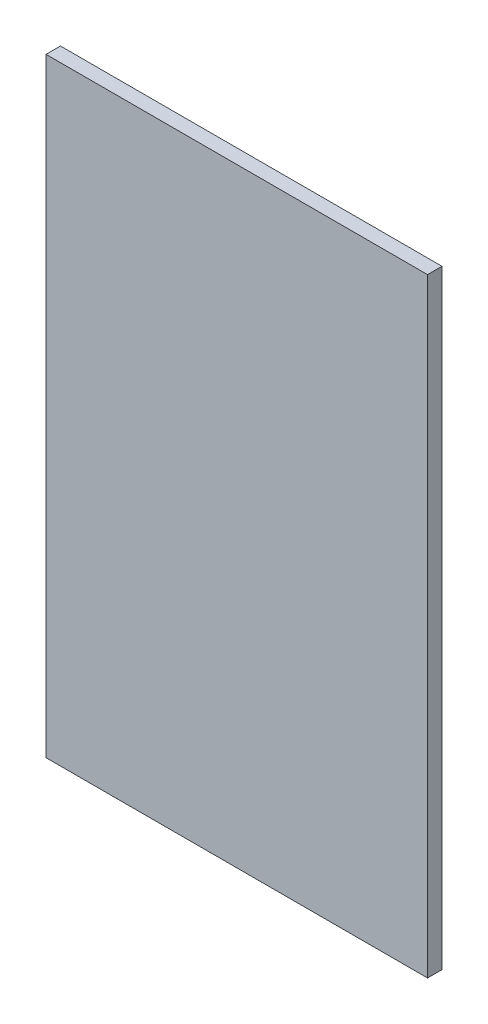
ISO-10303-21;
HEADER;
FILE_DESCRIPTION(('STEP AP214'),'2;1');
FILE_NAME('part.step','',(''),(''),'','','');
FILE_SCHEMA(('AUTOMOTIVE_DESIGN { 1 0 10303 214 1 1 1 1 }'));
ENDSEC;
DATA;
#1=APPLICATION_CONTEXT('core data for automotive mechanical design processes');
#2=APPLICATION_PROTOCOL_DEFINITION('international standard','automotive_design',2000,#1);
#3=PRODUCT_CONTEXT('',#1,'mechanical');
#4=PRODUCT('Part','Part','',(#3));
#5=PRODUCT_RELATED_PRODUCT_CATEGORY('part','',(#4));
#6=PRODUCT_DEFINITION_FORMATION('','',#4);
#7=PRODUCT_DEFINITION_CONTEXT('part definition',#1,'design');
#8=PRODUCT_DEFINITION('design','',#6,#7);
#9=PRODUCT_DEFINITION_SHAPE('','',#8);
#10=(LENGTH_UNIT() NAMED_UNIT(*) SI_UNIT(.MILLI.,.METRE.));
#11=(NAMED_UNIT(*) PLANE_ANGLE_UNIT() SI_UNIT($,.RADIAN.));
#12=(NAMED_UNIT(*) SI_UNIT($,.STERADIAN.) SOLID_ANGLE_UNIT());
#13=UNCERTAINTY_MEASURE_WITH_UNIT(LENGTH_MEASURE(1.E-05),#10,'distance_accuracy_value','');
#14=(GEOMETRIC_REPRESENTATION_CONTEXT(3) GLOBAL_UNCERTAINTY_ASSIGNED_CONTEXT((#13)) GLOBAL_UNIT_ASSIGNED_CONTEXT((#10,
#11,#12)) REPRESENTATION_CONTEXT('',''));
#15=CARTESIAN_POINT('',(0.,0.,0.));
#16=DIRECTION('',(0.,0.,1.));
#17=DIRECTION('',(1.,0.,0.));
#18=AXIS2_PLACEMENT_3D('',#15,#16,#17);
#19=CARTESIAN_POINT('',(-238.,-380.,18.));
#20=DIRECTION('',(1.,0.,0.));
#21=DIRECTION('',(0.,0.,-1.));
#22=AXIS2_PLACEMENT_3D('',#19,#20,#21);
#23=PLANE('',#22);
#24=DIRECTION('',(0.,-1.,0.));
#25=VECTOR('',#24,1.);
#26=CARTESIAN_POINT('',(-238.,-380.,0.));
#27=LINE('',#26,#25);
#28=CARTESIAN_POINT('',(-238.,380.,0.));
#29=VERTEX_POINT('',#28);
#30=CARTESIAN_POINT('',(-238.,-380.,0.));
#31=VERTEX_POINT('',#30);
#32=EDGE_CURVE('E96',#29,#31,#27,.T.);
#33=ORIENTED_EDGE('',*,*,#32,.T.);
#34=DIRECTION('',(0.,0.,-1.));
#35=VECTOR('',#34,1.);
#36=CARTESIAN_POINT('',(-238.,-380.,18.));
#37=LINE('',#36,#35);
#38=CARTESIAN_POINT('',(-238.,-380.,18.));
#39=VERTEX_POINT('',#38);
#40=EDGE_CURVE('E11',#39,#31,#37,.T.);
#41=ORIENTED_EDGE('',*,*,#40,.F.);
#42=DIRECTION('',(0.,-1.,0.));
#43=VECTOR('',#42,1.);
#44=CARTESIAN_POINT('',(-238.,-380.,18.));
#45=LINE('',#44,#43);
#46=CARTESIAN_POINT('',(-238.,380.,18.));
#47=VERTEX_POINT('',#46);
#48=EDGE_CURVE('E84',#47,#39,#45,.T.);
#49=ORIENTED_EDGE('',*,*,#48,.F.);
#50=DIRECTION('',(0.,0.,-1.));
#51=VECTOR('',#50,1.);
#52=CARTESIAN_POINT('',(-238.,380.,18.));
#53=LINE('',#52,#51);
#54=EDGE_CURVE('E92',#47,#29,#53,.T.);
#55=ORIENTED_EDGE('',*,*,#54,.T.);
#56=EDGE_LOOP('',(#33,#41,#49,#55));
#57=FACE_BOUND('',#56,.T.);
#58=ADVANCED_FACE('F33',(#57),#23,.F.);
#59=CARTESIAN_POINT('',(238.,-380.,18.));
#60=DIRECTION('',(0.,1.,0.));
#61=DIRECTION('',(-1.,0.,0.));
#62=AXIS2_PLACEMENT_3D('',#59,#60,#61);
#63=PLANE('',#62);
#64=DIRECTION('',(1.,0.,0.));
#65=VECTOR('',#64,1.);
#66=CARTESIAN_POINT('',(238.,-380.,0.));
#67=LINE('',#66,#65);
#68=CARTESIAN_POINT('',(238.,-380.,0.));
#69=VERTEX_POINT('',#68);
#70=EDGE_CURVE('E88',#31,#69,#67,.T.);
#71=ORIENTED_EDGE('',*,*,#70,.T.);
#72=DIRECTION('',(0.,0.,-1.));
#73=VECTOR('',#72,1.);
#74=CARTESIAN_POINT('',(238.,-380.,18.));
#75=LINE('',#74,#73);
#76=CARTESIAN_POINT('',(238.,-380.,18.));
#77=VERTEX_POINT('',#76);
#78=EDGE_CURVE('E41',#77,#69,#75,.T.);
#79=ORIENTED_EDGE('',*,*,#78,.F.);
#80=DIRECTION('',(1.,0.,0.));
#81=VECTOR('',#80,1.);
#82=CARTESIAN_POINT('',(238.,-380.,18.));
#83=LINE('',#82,#81);
#84=EDGE_CURVE('E79',#39,#77,#83,.T.);
#85=ORIENTED_EDGE('',*,*,#84,.F.);
#86=ORIENTED_EDGE('',*,*,#40,.T.);
#87=EDGE_LOOP('',(#71,#79,#85,#86));
#88=FACE_BOUND('',#87,.T.);
#89=ADVANCED_FACE('F87',(#88),#63,.F.);
#90=CARTESIAN_POINT('',(238.,-380.,18.));
#91=DIRECTION('',(-1.,0.,0.));
#92=DIRECTION('',(0.,0.,1.));
#93=AXIS2_PLACEMENT_3D('',#90,#91,#92);
#94=PLANE('',#93);
#95=DIRECTION('',(0.,1.,0.));
#96=VECTOR('',#95,1.);
#97=CARTESIAN_POINT('',(238.,-380.,0.));
#98=LINE('',#97,#96);
#99=CARTESIAN_POINT('',(238.,380.,0.));
#100=VERTEX_POINT('',#99);
#101=EDGE_CURVE('E66',#69,#100,#98,.T.);
#102=ORIENTED_EDGE('',*,*,#101,.T.);
#103=DIRECTION('',(0.,0.,-1.));
#104=VECTOR('',#103,1.);
#105=CARTESIAN_POINT('',(238.,380.,18.));
#106=LINE('',#105,#104);
#107=CARTESIAN_POINT('',(238.,380.,18.));
#108=VERTEX_POINT('',#107);
#109=EDGE_CURVE('E89',#108,#100,#106,.T.);
#110=ORIENTED_EDGE('',*,*,#109,.F.);
#111=DIRECTION('',(0.,1.,0.));
#112=VECTOR('',#111,1.);
#113=CARTESIAN_POINT('',(238.,-380.,18.));
#114=LINE('',#113,#112);
#115=EDGE_CURVE('E82',#77,#108,#114,.T.);
#116=ORIENTED_EDGE('',*,*,#115,.F.);
#117=ORIENTED_EDGE('',*,*,#78,.T.);
#118=EDGE_LOOP('',(#102,#110,#116,#117));
#119=FACE_BOUND('',#118,.T.);
#120=ADVANCED_FACE('F90',(#119),#94,.F.);
#121=CARTESIAN_POINT('',(238.,380.,18.));
#122=DIRECTION('',(0.,-1.,0.));
#123=DIRECTION('',(1.,0.,0.));
#124=AXIS2_PLACEMENT_3D('',#121,#122,#123);
#125=PLANE('',#124);
#126=DIRECTION('',(-1.,0.,0.));
#127=VECTOR('',#126,1.);
#128=CARTESIAN_POINT('',(238.,380.,0.));
#129=LINE('',#128,#127);
#130=EDGE_CURVE('E72',#100,#29,#129,.T.);
#131=ORIENTED_EDGE('',*,*,#130,.T.);
#132=ORIENTED_EDGE('',*,*,#54,.F.);
#133=DIRECTION('',(-1.,0.,0.));
#134=VECTOR('',#133,1.);
#135=CARTESIAN_POINT('',(238.,380.,18.));
#136=LINE('',#135,#134);
#137=EDGE_CURVE('E49',#108,#47,#136,.T.);
#138=ORIENTED_EDGE('',*,*,#137,.F.);
#139=ORIENTED_EDGE('',*,*,#109,.T.);
#140=EDGE_LOOP('',(#131,#132,#138,#139));
#141=FACE_BOUND('',#140,.T.);
#142=ADVANCED_FACE('F103',(#141),#125,.F.);
#143=CARTESIAN_POINT('',(0.,0.,18.));
#144=DIRECTION('',(0.,0.,1.));
#145=DIRECTION('',(1.,0.,0.));
#146=AXIS2_PLACEMENT_3D('',#143,#144,#145);
#147=PLANE('',#146);
#148=ORIENTED_EDGE('',*,*,#48,.T.);
#149=ORIENTED_EDGE('',*,*,#84,.T.);
#150=ORIENTED_EDGE('',*,*,#115,.T.);
#151=ORIENTED_EDGE('',*,*,#137,.T.);
#152=EDGE_LOOP('',(#148,#149,#150,#151));
#153=FACE_BOUND('',#152,.T.);
#154=ADVANCED_FACE('F80',(#153),#147,.T.);
#155=CARTESIAN_POINT('',(0.,0.,0.));
#156=DIRECTION('',(0.,0.,1.));
#157=DIRECTION('',(1.,0.,0.));
#158=AXIS2_PLACEMENT_3D('',#155,#156,#157);
#159=PLANE('',#158);
#160=ORIENTED_EDGE('',*,*,#32,.F.);
#161=ORIENTED_EDGE('',*,*,#130,.F.);
#162=ORIENTED_EDGE('',*,*,#101,.F.);
#163=ORIENTED_EDGE('',*,*,#70,.F.);
#164=EDGE_LOOP('',(#160,#161,#162,#163));
#165=FACE_BOUND('',#164,.T.);
#166=ADVANCED_FACE('F106',(#165),#159,.F.);
#167=CLOSED_SHELL('',(#58,#89,#120,#142,#154,#166));
#168=MANIFOLD_SOLID_BREP('B2',#167);
#169=ADVANCED_BREP_SHAPE_REPRESENTATION('',(#18,#168),#14);
#170=SHAPE_DEFINITION_REPRESENTATION(#9,#169);
ENDSEC;
END-ISO-10303-21;
